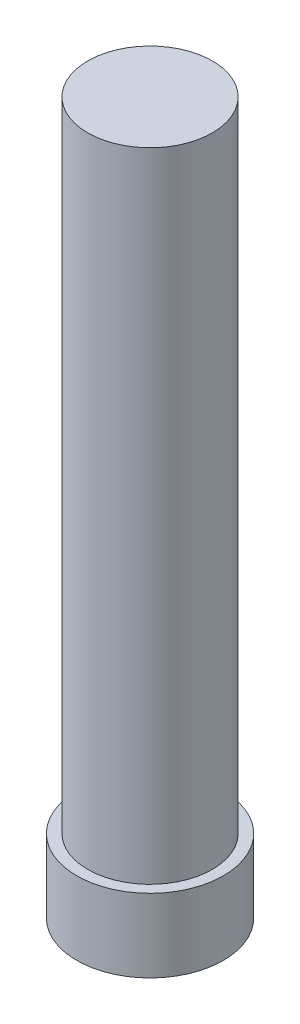
ISO-10303-21;
HEADER;
FILE_DESCRIPTION(('STEP AP214'),'2;1');
FILE_NAME('part.step','',(''),(''),'','','');
FILE_SCHEMA(('AUTOMOTIVE_DESIGN { 1 0 10303 214 1 1 1 1 }'));
ENDSEC;
DATA;
#1=APPLICATION_CONTEXT('core data for automotive mechanical design processes');
#2=APPLICATION_PROTOCOL_DEFINITION('international standard','automotive_design',2000,#1);
#3=PRODUCT_CONTEXT('',#1,'mechanical');
#4=PRODUCT('Part','Part','',(#3));
#5=PRODUCT_RELATED_PRODUCT_CATEGORY('part','',(#4));
#6=PRODUCT_DEFINITION_FORMATION('','',#4);
#7=PRODUCT_DEFINITION_CONTEXT('part definition',#1,'design');
#8=PRODUCT_DEFINITION('design','',#6,#7);
#9=PRODUCT_DEFINITION_SHAPE('','',#8);
#10=(LENGTH_UNIT() NAMED_UNIT(*) SI_UNIT(.MILLI.,.METRE.));
#11=(NAMED_UNIT(*) PLANE_ANGLE_UNIT() SI_UNIT($,.RADIAN.));
#12=(NAMED_UNIT(*) SI_UNIT($,.STERADIAN.) SOLID_ANGLE_UNIT());
#13=UNCERTAINTY_MEASURE_WITH_UNIT(LENGTH_MEASURE(1.E-05),#10,'distance_accuracy_value','');
#14=(GEOMETRIC_REPRESENTATION_CONTEXT(3) GLOBAL_UNCERTAINTY_ASSIGNED_CONTEXT((#13)) GLOBAL_UNIT_ASSIGNED_CONTEXT((#10,
#11,#12)) REPRESENTATION_CONTEXT('',''));
#15=CARTESIAN_POINT('',(0.,0.,0.));
#16=DIRECTION('',(0.,0.,1.));
#17=DIRECTION('',(1.,0.,0.));
#18=AXIS2_PLACEMENT_3D('',#15,#16,#17);
#19=CARTESIAN_POINT('',(0.,8.7,0.));
#20=DIRECTION('',(0.,-1.,0.));
#21=DIRECTION('',(0.,0.,-1.));
#22=AXIS2_PLACEMENT_3D('',#19,#20,#21);
#23=CYLINDRICAL_SURFACE('',#22,0.85);
#24=CARTESIAN_POINT('',(0.,8.7,0.));
#25=DIRECTION('',(0.,1.,0.));
#26=DIRECTION('',(0.,0.,1.));
#27=AXIS2_PLACEMENT_3D('',#24,#25,#26);
#28=CIRCLE('',#27,0.85);
#29=CARTESIAN_POINT('',(0.,8.7,0.85));
#30=VERTEX_POINT('',#29);
#31=EDGE_CURVE('E10',#30,#30,#28,.T.);
#32=ORIENTED_EDGE('',*,*,#31,.F.);
#33=EDGE_LOOP('',(#32));
#34=FACE_BOUND('',#33,.T.);
#35=CARTESIAN_POINT('',(0.,0.,0.));
#36=DIRECTION('',(0.,1.,0.));
#37=DIRECTION('',(0.,0.,1.));
#38=AXIS2_PLACEMENT_3D('',#35,#36,#37);
#39=CIRCLE('',#38,0.85);
#40=CARTESIAN_POINT('',(0.,0.,0.85));
#41=VERTEX_POINT('',#40);
#42=EDGE_CURVE('E38',#41,#41,#39,.T.);
#43=ORIENTED_EDGE('',*,*,#42,.T.);
#44=EDGE_LOOP('',(#43));
#45=FACE_BOUND('',#44,.T.);
#46=ADVANCED_FACE('F35',(#34,#45),#23,.T.);
#47=CARTESIAN_POINT('',(0.,8.7,0.));
#48=DIRECTION('',(0.,1.,0.));
#49=DIRECTION('',(0.,0.,1.));
#50=AXIS2_PLACEMENT_3D('',#47,#48,#49);
#51=PLANE('',#50);
#52=ORIENTED_EDGE('',*,*,#31,.T.);
#53=EDGE_LOOP('',(#52));
#54=FACE_BOUND('',#53,.T.);
#55=ADVANCED_FACE('F58',(#54),#51,.T.);
#56=CARTESIAN_POINT('',(0.,-1.,0.));
#57=DIRECTION('',(0.,1.,0.));
#58=DIRECTION('',(0.,0.,1.));
#59=AXIS2_PLACEMENT_3D('',#56,#57,#58);
#60=CYLINDRICAL_SURFACE('',#59,1.);
#61=CARTESIAN_POINT('',(0.,-1.,0.));
#62=DIRECTION('',(0.,-1.,0.));
#63=DIRECTION('',(0.,0.,-1.));
#64=AXIS2_PLACEMENT_3D('',#61,#62,#63);
#65=CIRCLE('',#64,1.);
#66=CARTESIAN_POINT('',(0.,-1.,-1.));
#67=VERTEX_POINT('',#66);
#68=EDGE_CURVE('E45',#67,#67,#65,.T.);
#69=ORIENTED_EDGE('',*,*,#68,.F.);
#70=EDGE_LOOP('',(#69));
#71=FACE_BOUND('',#70,.T.);
#72=CARTESIAN_POINT('',(0.,0.,0.));
#73=DIRECTION('',(0.,-1.,0.));
#74=DIRECTION('',(0.,0.,-1.));
#75=AXIS2_PLACEMENT_3D('',#72,#73,#74);
#76=CIRCLE('',#75,1.);
#77=CARTESIAN_POINT('',(0.,0.,-1.));
#78=VERTEX_POINT('',#77);
#79=EDGE_CURVE('E47',#78,#78,#76,.T.);
#80=ORIENTED_EDGE('',*,*,#79,.T.);
#81=EDGE_LOOP('',(#80));
#82=FACE_BOUND('',#81,.T.);
#83=ADVANCED_FACE('F55',(#71,#82),#60,.T.);
#84=CARTESIAN_POINT('',(0.,-1.,0.));
#85=DIRECTION('',(0.,-1.,0.));
#86=DIRECTION('',(0.,0.,-1.));
#87=AXIS2_PLACEMENT_3D('',#84,#85,#86);
#88=PLANE('',#87);
#89=ORIENTED_EDGE('',*,*,#68,.T.);
#90=EDGE_LOOP('',(#89));
#91=FACE_BOUND('',#90,.T.);
#92=ADVANCED_FACE('F53',(#91),#88,.T.);
#93=CARTESIAN_POINT('',(0.,0.,0.));
#94=DIRECTION('',(0.,-1.,0.));
#95=DIRECTION('',(0.,0.,-1.));
#96=AXIS2_PLACEMENT_3D('',#93,#94,#95);
#97=PLANE('',#96);
#98=ORIENTED_EDGE('',*,*,#42,.F.);
#99=EDGE_LOOP('',(#98));
#100=FACE_BOUND('',#99,.T.);
#101=ORIENTED_EDGE('',*,*,#79,.F.);
#102=EDGE_LOOP('',(#101));
#103=FACE_BOUND('',#102,.T.);
#104=ADVANCED_FACE('F62',(#100,#103),#97,.F.);
#105=CLOSED_SHELL('',(#46,#55,#83,#92,#104));
#106=MANIFOLD_SOLID_BREP('B2',#105);
#107=ADVANCED_BREP_SHAPE_REPRESENTATION('',(#18,#106),#14);
#108=SHAPE_DEFINITION_REPRESENTATION(#9,#107);
ENDSEC;
END-ISO-10303-21;
